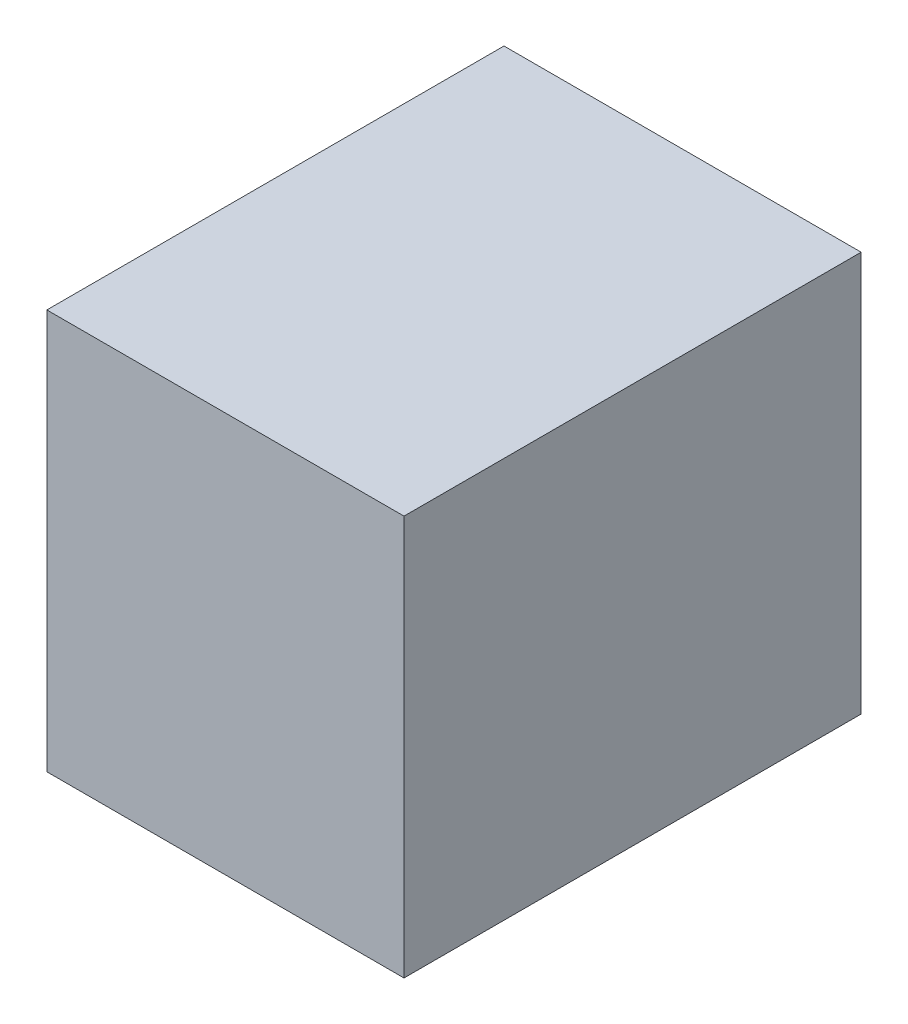
ISO-10303-21;
HEADER;
FILE_DESCRIPTION(('STEP AP214'),'2;1');
FILE_NAME('part.step','',(''),(''),'','','');
FILE_SCHEMA(('AUTOMOTIVE_DESIGN { 1 0 10303 214 1 1 1 1 }'));
ENDSEC;
DATA;
#1=APPLICATION_CONTEXT('core data for automotive mechanical design processes');
#2=APPLICATION_PROTOCOL_DEFINITION('international standard','automotive_design',2000,#1);
#3=PRODUCT_CONTEXT('',#1,'mechanical');
#4=PRODUCT('Part','Part','',(#3));
#5=PRODUCT_RELATED_PRODUCT_CATEGORY('part','',(#4));
#6=PRODUCT_DEFINITION_FORMATION('','',#4);
#7=PRODUCT_DEFINITION_CONTEXT('part definition',#1,'design');
#8=PRODUCT_DEFINITION('design','',#6,#7);
#9=PRODUCT_DEFINITION_SHAPE('','',#8);
#10=(LENGTH_UNIT() NAMED_UNIT(*) SI_UNIT(.MILLI.,.METRE.));
#11=(NAMED_UNIT(*) PLANE_ANGLE_UNIT() SI_UNIT($,.RADIAN.));
#12=(NAMED_UNIT(*) SI_UNIT($,.STERADIAN.) SOLID_ANGLE_UNIT());
#13=UNCERTAINTY_MEASURE_WITH_UNIT(LENGTH_MEASURE(1.E-05),#10,'distance_accuracy_value','');
#14=(GEOMETRIC_REPRESENTATION_CONTEXT(3) GLOBAL_UNCERTAINTY_ASSIGNED_CONTEXT((#13)) GLOBAL_UNIT_ASSIGNED_CONTEXT((#10,
#11,#12)) REPRESENTATION_CONTEXT('',''));
#15=CARTESIAN_POINT('',(0.,0.,0.));
#16=DIRECTION('',(0.,0.,1.));
#17=DIRECTION('',(1.,0.,0.));
#18=AXIS2_PLACEMENT_3D('',#15,#16,#17);
#19=CARTESIAN_POINT('',(250.,140.,-160.));
#20=DIRECTION('',(0.,0.,1.));
#21=DIRECTION('',(0.,-1.,0.));
#22=AXIS2_PLACEMENT_3D('',#19,#20,#21);
#23=PLANE('',#22);
#24=DIRECTION('',(0.,1.,0.));
#25=VECTOR('',#24,1.);
#26=CARTESIAN_POINT('',(0.,140.,-160.));
#27=LINE('',#26,#25);
#28=CARTESIAN_POINT('',(0.,-140.,-160.));
#29=VERTEX_POINT('',#28);
#30=CARTESIAN_POINT('',(0.,140.,-160.));
#31=VERTEX_POINT('',#30);
#32=EDGE_CURVE('E99',#29,#31,#27,.T.);
#33=ORIENTED_EDGE('',*,*,#32,.T.);
#34=DIRECTION('',(-1.,0.,0.));
#35=VECTOR('',#34,1.);
#36=CARTESIAN_POINT('',(250.,140.,-160.));
#37=LINE('',#36,#35);
#38=CARTESIAN_POINT('',(250.,140.,-160.));
#39=VERTEX_POINT('',#38);
#40=EDGE_CURVE('E11',#39,#31,#37,.T.);
#41=ORIENTED_EDGE('',*,*,#40,.F.);
#42=DIRECTION('',(0.,1.,0.));
#43=VECTOR('',#42,1.);
#44=CARTESIAN_POINT('',(250.,140.,-160.));
#45=LINE('',#44,#43);
#46=CARTESIAN_POINT('',(250.,-140.,-160.));
#47=VERTEX_POINT('',#46);
#48=EDGE_CURVE('E87',#47,#39,#45,.T.);
#49=ORIENTED_EDGE('',*,*,#48,.F.);
#50=DIRECTION('',(-1.,0.,0.));
#51=VECTOR('',#50,1.);
#52=CARTESIAN_POINT('',(250.,-140.,-160.));
#53=LINE('',#52,#51);
#54=EDGE_CURVE('E95',#47,#29,#53,.T.);
#55=ORIENTED_EDGE('',*,*,#54,.T.);
#56=EDGE_LOOP('',(#33,#41,#49,#55));
#57=FACE_BOUND('',#56,.T.);
#58=ADVANCED_FACE('F36',(#57),#23,.F.);
#59=CARTESIAN_POINT('',(250.,140.,160.));
#60=DIRECTION('',(0.,-1.,0.));
#61=DIRECTION('',(0.,0.,-1.));
#62=AXIS2_PLACEMENT_3D('',#59,#60,#61);
#63=PLANE('',#62);
#64=DIRECTION('',(0.,0.,1.));
#65=VECTOR('',#64,1.);
#66=CARTESIAN_POINT('',(0.,140.,160.));
#67=LINE('',#66,#65);
#68=CARTESIAN_POINT('',(0.,140.,160.));
#69=VERTEX_POINT('',#68);
#70=EDGE_CURVE('E91',#31,#69,#67,.T.);
#71=ORIENTED_EDGE('',*,*,#70,.T.);
#72=DIRECTION('',(-1.,0.,0.));
#73=VECTOR('',#72,1.);
#74=CARTESIAN_POINT('',(250.,140.,160.));
#75=LINE('',#74,#73);
#76=CARTESIAN_POINT('',(250.,140.,160.));
#77=VERTEX_POINT('',#76);
#78=EDGE_CURVE('E44',#77,#69,#75,.T.);
#79=ORIENTED_EDGE('',*,*,#78,.F.);
#80=DIRECTION('',(0.,0.,1.));
#81=VECTOR('',#80,1.);
#82=CARTESIAN_POINT('',(250.,140.,160.));
#83=LINE('',#82,#81);
#84=EDGE_CURVE('E82',#39,#77,#83,.T.);
#85=ORIENTED_EDGE('',*,*,#84,.F.);
#86=ORIENTED_EDGE('',*,*,#40,.T.);
#87=EDGE_LOOP('',(#71,#79,#85,#86));
#88=FACE_BOUND('',#87,.T.);
#89=ADVANCED_FACE('F90',(#88),#63,.F.);
#90=CARTESIAN_POINT('',(250.,140.,160.));
#91=DIRECTION('',(0.,0.,-1.));
#92=DIRECTION('',(0.,1.,0.));
#93=AXIS2_PLACEMENT_3D('',#90,#91,#92);
#94=PLANE('',#93);
#95=DIRECTION('',(0.,-1.,0.));
#96=VECTOR('',#95,1.);
#97=CARTESIAN_POINT('',(0.,140.,160.));
#98=LINE('',#97,#96);
#99=CARTESIAN_POINT('',(0.,-140.,160.));
#100=VERTEX_POINT('',#99);
#101=EDGE_CURVE('E69',#69,#100,#98,.T.);
#102=ORIENTED_EDGE('',*,*,#101,.T.);
#103=DIRECTION('',(-1.,0.,0.));
#104=VECTOR('',#103,1.);
#105=CARTESIAN_POINT('',(250.,-140.,160.));
#106=LINE('',#105,#104);
#107=CARTESIAN_POINT('',(250.,-140.,160.));
#108=VERTEX_POINT('',#107);
#109=EDGE_CURVE('E92',#108,#100,#106,.T.);
#110=ORIENTED_EDGE('',*,*,#109,.F.);
#111=DIRECTION('',(0.,-1.,0.));
#112=VECTOR('',#111,1.);
#113=CARTESIAN_POINT('',(250.,140.,160.));
#114=LINE('',#113,#112);
#115=EDGE_CURVE('E85',#77,#108,#114,.T.);
#116=ORIENTED_EDGE('',*,*,#115,.F.);
#117=ORIENTED_EDGE('',*,*,#78,.T.);
#118=EDGE_LOOP('',(#102,#110,#116,#117));
#119=FACE_BOUND('',#118,.T.);
#120=ADVANCED_FACE('F93',(#119),#94,.F.);
#121=CARTESIAN_POINT('',(250.,-140.,160.));
#122=DIRECTION('',(0.,1.,0.));
#123=DIRECTION('',(0.,0.,1.));
#124=AXIS2_PLACEMENT_3D('',#121,#122,#123);
#125=PLANE('',#124);
#126=DIRECTION('',(0.,0.,-1.));
#127=VECTOR('',#126,1.);
#128=CARTESIAN_POINT('',(0.,-140.,160.));
#129=LINE('',#128,#127);
#130=EDGE_CURVE('E75',#100,#29,#129,.T.);
#131=ORIENTED_EDGE('',*,*,#130,.T.);
#132=ORIENTED_EDGE('',*,*,#54,.F.);
#133=DIRECTION('',(0.,0.,-1.));
#134=VECTOR('',#133,1.);
#135=CARTESIAN_POINT('',(250.,-140.,160.));
#136=LINE('',#135,#134);
#137=EDGE_CURVE('E52',#108,#47,#136,.T.);
#138=ORIENTED_EDGE('',*,*,#137,.F.);
#139=ORIENTED_EDGE('',*,*,#109,.T.);
#140=EDGE_LOOP('',(#131,#132,#138,#139));
#141=FACE_BOUND('',#140,.T.);
#142=ADVANCED_FACE('F106',(#141),#125,.F.);
#143=CARTESIAN_POINT('',(250.,0.,0.));
#144=DIRECTION('',(1.,0.,0.));
#145=DIRECTION('',(0.,0.,-1.));
#146=AXIS2_PLACEMENT_3D('',#143,#144,#145);
#147=PLANE('',#146);
#148=ORIENTED_EDGE('',*,*,#48,.T.);
#149=ORIENTED_EDGE('',*,*,#84,.T.);
#150=ORIENTED_EDGE('',*,*,#115,.T.);
#151=ORIENTED_EDGE('',*,*,#137,.T.);
#152=EDGE_LOOP('',(#148,#149,#150,#151));
#153=FACE_BOUND('',#152,.T.);
#154=ADVANCED_FACE('F83',(#153),#147,.T.);
#155=CARTESIAN_POINT('',(0.,0.,0.));
#156=DIRECTION('',(1.,0.,0.));
#157=DIRECTION('',(0.,0.,-1.));
#158=AXIS2_PLACEMENT_3D('',#155,#156,#157);
#159=PLANE('',#158);
#160=ORIENTED_EDGE('',*,*,#32,.F.);
#161=ORIENTED_EDGE('',*,*,#130,.F.);
#162=ORIENTED_EDGE('',*,*,#101,.F.);
#163=ORIENTED_EDGE('',*,*,#70,.F.);
#164=EDGE_LOOP('',(#160,#161,#162,#163));
#165=FACE_BOUND('',#164,.T.);
#166=ADVANCED_FACE('F109',(#165),#159,.F.);
#167=CLOSED_SHELL('',(#58,#89,#120,#142,#154,#166));
#168=MANIFOLD_SOLID_BREP('B2',#167);
#169=ADVANCED_BREP_SHAPE_REPRESENTATION('',(#18,#168),#14);
#170=SHAPE_DEFINITION_REPRESENTATION(#9,#169);
ENDSEC;
END-ISO-10303-21;
